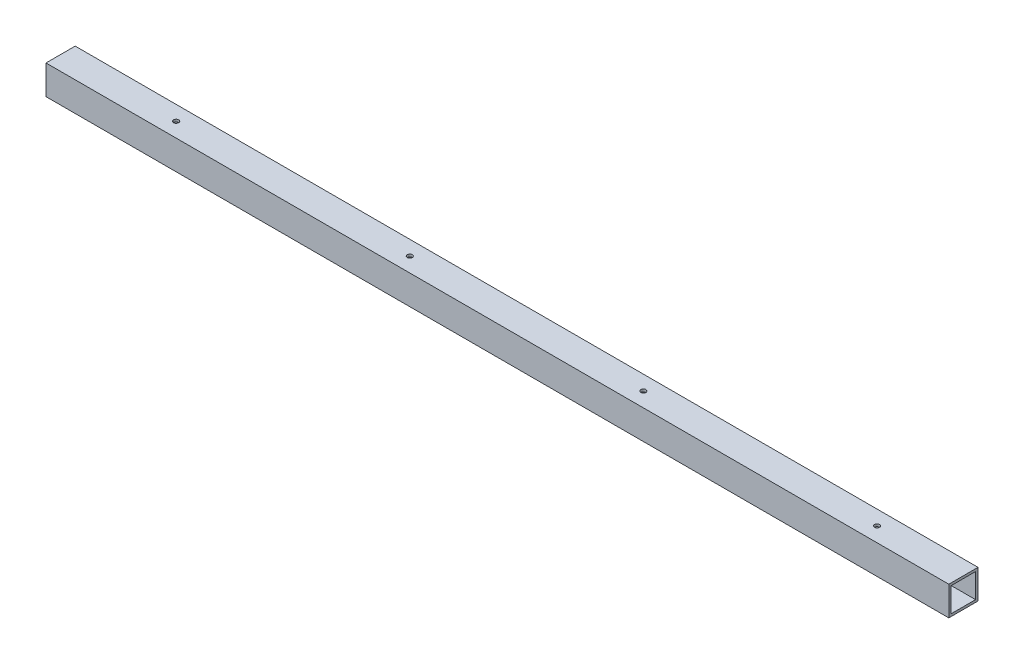
ISO-10303-21;
HEADER;
FILE_DESCRIPTION(('STEP AP214'),'2;1');
FILE_NAME('part.step','',(''),(''),'','','');
FILE_SCHEMA(('AUTOMOTIVE_DESIGN { 1 0 10303 214 1 1 1 1 }'));
ENDSEC;
DATA;
#1=APPLICATION_CONTEXT('core data for automotive mechanical design processes');
#2=APPLICATION_PROTOCOL_DEFINITION('international standard','automotive_design',2000,#1);
#3=PRODUCT_CONTEXT('',#1,'mechanical');
#4=PRODUCT('Part','Part','',(#3));
#5=PRODUCT_RELATED_PRODUCT_CATEGORY('part','',(#4));
#6=PRODUCT_DEFINITION_FORMATION('','',#4);
#7=PRODUCT_DEFINITION_CONTEXT('part definition',#1,'design');
#8=PRODUCT_DEFINITION('design','',#6,#7);
#9=PRODUCT_DEFINITION_SHAPE('','',#8);
#10=(LENGTH_UNIT() NAMED_UNIT(*) SI_UNIT(.MILLI.,.METRE.));
#11=(NAMED_UNIT(*) PLANE_ANGLE_UNIT() SI_UNIT($,.RADIAN.));
#12=(NAMED_UNIT(*) SI_UNIT($,.STERADIAN.) SOLID_ANGLE_UNIT());
#13=UNCERTAINTY_MEASURE_WITH_UNIT(LENGTH_MEASURE(1.E-05),#10,'distance_accuracy_value','');
#14=(GEOMETRIC_REPRESENTATION_CONTEXT(3) GLOBAL_UNCERTAINTY_ASSIGNED_CONTEXT((#13)) GLOBAL_UNIT_ASSIGNED_CONTEXT((#10,
#11,#12)) REPRESENTATION_CONTEXT('',''));
#15=CARTESIAN_POINT('',(0.,0.,0.));
#16=DIRECTION('',(0.,0.,1.));
#17=DIRECTION('',(1.,0.,0.));
#18=AXIS2_PLACEMENT_3D('',#15,#16,#17);
#19=CARTESIAN_POINT('',(476.25,-19.05,0.));
#20=DIRECTION('',(0.,1.,0.));
#21=DIRECTION('',(0.,0.,1.));
#22=AXIS2_PLACEMENT_3D('',#19,#20,#21);
#23=CYLINDRICAL_SURFACE('',#22,3.302);
#24=CARTESIAN_POINT('',(476.25,15.875,0.));
#25=DIRECTION('',(0.,1.,0.));
#26=DIRECTION('',(0.,0.,1.));
#27=AXIS2_PLACEMENT_3D('',#24,#25,#26);
#28=CIRCLE('',#27,3.302);
#29=CARTESIAN_POINT('',(476.25,15.875,3.302));
#30=VERTEX_POINT('',#29);
#31=EDGE_CURVE('E123',#30,#30,#28,.T.);
#32=ORIENTED_EDGE('',*,*,#31,.F.);
#33=EDGE_LOOP('',(#32));
#34=FACE_BOUND('',#33,.T.);
#35=CARTESIAN_POINT('',(476.25,19.05,0.));
#36=DIRECTION('',(0.,1.,0.));
#37=DIRECTION('',(0.,0.,1.));
#38=AXIS2_PLACEMENT_3D('',#35,#36,#37);
#39=CIRCLE('',#38,3.302);
#40=CARTESIAN_POINT('',(476.25,19.05,3.302));
#41=VERTEX_POINT('',#40);
#42=EDGE_CURVE('E120',#41,#41,#39,.F.);
#43=ORIENTED_EDGE('',*,*,#42,.F.);
#44=EDGE_LOOP('',(#43));
#45=FACE_BOUND('',#44,.T.);
#46=ADVANCED_FACE('F17',(#34,#45),#23,.F.);
#47=CARTESIAN_POINT('',(171.45,-19.05,0.));
#48=DIRECTION('',(0.,1.,0.));
#49=DIRECTION('',(0.,0.,1.));
#50=AXIS2_PLACEMENT_3D('',#47,#48,#49);
#51=CYLINDRICAL_SURFACE('',#50,3.302);
#52=CARTESIAN_POINT('',(171.45,15.875,0.));
#53=DIRECTION('',(0.,1.,0.));
#54=DIRECTION('',(0.,0.,1.));
#55=AXIS2_PLACEMENT_3D('',#52,#53,#54);
#56=CIRCLE('',#55,3.302);
#57=CARTESIAN_POINT('',(171.45,15.875,3.302));
#58=VERTEX_POINT('',#57);
#59=EDGE_CURVE('E156',#58,#58,#56,.T.);
#60=ORIENTED_EDGE('',*,*,#59,.F.);
#61=EDGE_LOOP('',(#60));
#62=FACE_BOUND('',#61,.T.);
#63=CARTESIAN_POINT('',(171.45,19.05,0.));
#64=DIRECTION('',(0.,1.,0.));
#65=DIRECTION('',(0.,0.,1.));
#66=AXIS2_PLACEMENT_3D('',#63,#64,#65);
#67=CIRCLE('',#66,3.302);
#68=CARTESIAN_POINT('',(171.45,19.05,3.302));
#69=VERTEX_POINT('',#68);
#70=EDGE_CURVE('E146',#69,#69,#67,.F.);
#71=ORIENTED_EDGE('',*,*,#70,.F.);
#72=EDGE_LOOP('',(#71));
#73=FACE_BOUND('',#72,.T.);
#74=ADVANCED_FACE('F361',(#62,#73),#51,.F.);
#75=CARTESIAN_POINT('',(-133.35,-19.05,0.));
#76=DIRECTION('',(0.,1.,0.));
#77=DIRECTION('',(0.,0.,1.));
#78=AXIS2_PLACEMENT_3D('',#75,#76,#77);
#79=CYLINDRICAL_SURFACE('',#78,3.302);
#80=CARTESIAN_POINT('',(-133.35,15.875,0.));
#81=DIRECTION('',(0.,1.,0.));
#82=DIRECTION('',(0.,0.,1.));
#83=AXIS2_PLACEMENT_3D('',#80,#81,#82);
#84=CIRCLE('',#83,3.302);
#85=CARTESIAN_POINT('',(-133.35,15.875,3.302));
#86=VERTEX_POINT('',#85);
#87=EDGE_CURVE('E153',#86,#86,#84,.T.);
#88=ORIENTED_EDGE('',*,*,#87,.F.);
#89=EDGE_LOOP('',(#88));
#90=FACE_BOUND('',#89,.T.);
#91=CARTESIAN_POINT('',(-133.35,19.05,0.));
#92=DIRECTION('',(0.,1.,0.));
#93=DIRECTION('',(0.,0.,1.));
#94=AXIS2_PLACEMENT_3D('',#91,#92,#93);
#95=CIRCLE('',#94,3.302);
#96=CARTESIAN_POINT('',(-133.35,19.05,3.302));
#97=VERTEX_POINT('',#96);
#98=EDGE_CURVE('E143',#97,#97,#95,.F.);
#99=ORIENTED_EDGE('',*,*,#98,.F.);
#100=EDGE_LOOP('',(#99));
#101=FACE_BOUND('',#100,.T.);
#102=ADVANCED_FACE('F351',(#90,#101),#79,.F.);
#103=CARTESIAN_POINT('',(-438.15,-19.05,0.));
#104=DIRECTION('',(0.,1.,0.));
#105=DIRECTION('',(0.,0.,1.));
#106=AXIS2_PLACEMENT_3D('',#103,#104,#105);
#107=CYLINDRICAL_SURFACE('',#106,3.302);
#108=CARTESIAN_POINT('',(-438.15,15.875,0.));
#109=DIRECTION('',(0.,1.,0.));
#110=DIRECTION('',(0.,0.,1.));
#111=AXIS2_PLACEMENT_3D('',#108,#109,#110);
#112=CIRCLE('',#111,3.302);
#113=CARTESIAN_POINT('',(-438.15,15.875,3.302));
#114=VERTEX_POINT('',#113);
#115=EDGE_CURVE('E121',#114,#114,#112,.T.);
#116=ORIENTED_EDGE('',*,*,#115,.F.);
#117=EDGE_LOOP('',(#116));
#118=FACE_BOUND('',#117,.T.);
#119=CARTESIAN_POINT('',(-438.15,19.05,0.));
#120=DIRECTION('',(0.,1.,0.));
#121=DIRECTION('',(0.,0.,1.));
#122=AXIS2_PLACEMENT_3D('',#119,#120,#121);
#123=CIRCLE('',#122,3.302);
#124=CARTESIAN_POINT('',(-438.15,19.05,3.302));
#125=VERTEX_POINT('',#124);
#126=EDGE_CURVE('E116',#125,#125,#123,.F.);
#127=ORIENTED_EDGE('',*,*,#126,.F.);
#128=EDGE_LOOP('',(#127));
#129=FACE_BOUND('',#128,.T.);
#130=ADVANCED_FACE('F177',(#118,#129),#107,.F.);
#131=CARTESIAN_POINT('',(476.25,-19.05,0.));
#132=DIRECTION('',(0.,1.,0.));
#133=DIRECTION('',(0.,0.,1.));
#134=AXIS2_PLACEMENT_3D('',#131,#132,#133);
#135=CYLINDRICAL_SURFACE('',#134,3.302);
#136=CARTESIAN_POINT('',(476.25,-15.875,0.));
#137=DIRECTION('',(0.,1.,0.));
#138=DIRECTION('',(0.,0.,1.));
#139=AXIS2_PLACEMENT_3D('',#136,#137,#138);
#140=CIRCLE('',#139,3.302);
#141=CARTESIAN_POINT('',(476.25,-15.875,3.302));
#142=VERTEX_POINT('',#141);
#143=EDGE_CURVE('E20',#142,#142,#140,.F.);
#144=ORIENTED_EDGE('',*,*,#143,.F.);
#145=EDGE_LOOP('',(#144));
#146=FACE_BOUND('',#145,.T.);
#147=CARTESIAN_POINT('',(476.25,-19.05,0.));
#148=DIRECTION('',(0.,1.,0.));
#149=DIRECTION('',(0.,0.,1.));
#150=AXIS2_PLACEMENT_3D('',#147,#148,#149);
#151=CIRCLE('',#150,3.302);
#152=CARTESIAN_POINT('',(476.25,-19.05,3.302));
#153=VERTEX_POINT('',#152);
#154=EDGE_CURVE('E137',#153,#153,#151,.T.);
#155=ORIENTED_EDGE('',*,*,#154,.F.);
#156=EDGE_LOOP('',(#155));
#157=FACE_BOUND('',#156,.T.);
#158=ADVANCED_FACE('F173',(#146,#157),#135,.F.);
#159=CARTESIAN_POINT('',(171.45,-19.05,0.));
#160=DIRECTION('',(0.,1.,0.));
#161=DIRECTION('',(0.,0.,1.));
#162=AXIS2_PLACEMENT_3D('',#159,#160,#161);
#163=CYLINDRICAL_SURFACE('',#162,3.302);
#164=CARTESIAN_POINT('',(171.45,-15.875,0.));
#165=DIRECTION('',(0.,1.,0.));
#166=DIRECTION('',(0.,0.,1.));
#167=AXIS2_PLACEMENT_3D('',#164,#165,#166);
#168=CIRCLE('',#167,3.302);
#169=CARTESIAN_POINT('',(171.45,-15.875,3.302));
#170=VERTEX_POINT('',#169);
#171=EDGE_CURVE('E165',#170,#170,#168,.F.);
#172=ORIENTED_EDGE('',*,*,#171,.F.);
#173=EDGE_LOOP('',(#172));
#174=FACE_BOUND('',#173,.T.);
#175=CARTESIAN_POINT('',(171.45,-19.05,0.));
#176=DIRECTION('',(0.,1.,0.));
#177=DIRECTION('',(0.,0.,1.));
#178=AXIS2_PLACEMENT_3D('',#175,#176,#177);
#179=CIRCLE('',#178,3.302);
#180=CARTESIAN_POINT('',(171.45,-19.05,3.302));
#181=VERTEX_POINT('',#180);
#182=EDGE_CURVE('E134',#181,#181,#179,.T.);
#183=ORIENTED_EDGE('',*,*,#182,.F.);
#184=EDGE_LOOP('',(#183));
#185=FACE_BOUND('',#184,.T.);
#186=ADVANCED_FACE('F176',(#174,#185),#163,.F.);
#187=CARTESIAN_POINT('',(-133.35,-19.05,0.));
#188=DIRECTION('',(0.,1.,0.));
#189=DIRECTION('',(0.,0.,1.));
#190=AXIS2_PLACEMENT_3D('',#187,#188,#189);
#191=CYLINDRICAL_SURFACE('',#190,3.302);
#192=CARTESIAN_POINT('',(-133.35,-15.875,0.));
#193=DIRECTION('',(0.,1.,0.));
#194=DIRECTION('',(0.,0.,1.));
#195=AXIS2_PLACEMENT_3D('',#192,#193,#194);
#196=CIRCLE('',#195,3.302);
#197=CARTESIAN_POINT('',(-133.35,-15.875,3.302));
#198=VERTEX_POINT('',#197);
#199=EDGE_CURVE('E163',#198,#198,#196,.F.);
#200=ORIENTED_EDGE('',*,*,#199,.F.);
#201=EDGE_LOOP('',(#200));
#202=FACE_BOUND('',#201,.T.);
#203=CARTESIAN_POINT('',(-133.35,-19.05,0.));
#204=DIRECTION('',(0.,1.,0.));
#205=DIRECTION('',(0.,0.,1.));
#206=AXIS2_PLACEMENT_3D('',#203,#204,#205);
#207=CIRCLE('',#206,3.302);
#208=CARTESIAN_POINT('',(-133.35,-19.05,3.302));
#209=VERTEX_POINT('',#208);
#210=EDGE_CURVE('E131',#209,#209,#207,.T.);
#211=ORIENTED_EDGE('',*,*,#210,.F.);
#212=EDGE_LOOP('',(#211));
#213=FACE_BOUND('',#212,.T.);
#214=ADVANCED_FACE('F317',(#202,#213),#191,.F.);
#215=CARTESIAN_POINT('',(-438.15,-19.05,0.));
#216=DIRECTION('',(0.,1.,0.));
#217=DIRECTION('',(0.,0.,1.));
#218=AXIS2_PLACEMENT_3D('',#215,#216,#217);
#219=CYLINDRICAL_SURFACE('',#218,3.302);
#220=CARTESIAN_POINT('',(-438.15,-15.875,0.));
#221=DIRECTION('',(0.,1.,0.));
#222=DIRECTION('',(0.,0.,1.));
#223=AXIS2_PLACEMENT_3D('',#220,#221,#222);
#224=CIRCLE('',#223,3.302);
#225=CARTESIAN_POINT('',(-438.15,-15.875,3.302));
#226=VERTEX_POINT('',#225);
#227=EDGE_CURVE('E92',#226,#226,#224,.F.);
#228=ORIENTED_EDGE('',*,*,#227,.F.);
#229=EDGE_LOOP('',(#228));
#230=FACE_BOUND('',#229,.T.);
#231=CARTESIAN_POINT('',(-438.15,-19.05,0.));
#232=DIRECTION('',(0.,1.,0.));
#233=DIRECTION('',(0.,0.,1.));
#234=AXIS2_PLACEMENT_3D('',#231,#232,#233);
#235=CIRCLE('',#234,3.302);
#236=CARTESIAN_POINT('',(-438.15,-19.05,3.302));
#237=VERTEX_POINT('',#236);
#238=EDGE_CURVE('E127',#237,#237,#235,.T.);
#239=ORIENTED_EDGE('',*,*,#238,.F.);
#240=EDGE_LOOP('',(#239));
#241=FACE_BOUND('',#240,.T.);
#242=ADVANCED_FACE('F308',(#230,#241),#219,.F.);
#243=CARTESIAN_POINT('',(-588.9625,19.05,19.05));
#244=DIRECTION('',(0.,0.,1.));
#245=DIRECTION('',(1.,0.,0.));
#246=AXIS2_PLACEMENT_3D('',#243,#244,#245);
#247=PLANE('',#246);
#248=DIRECTION('',(1.,0.,0.));
#249=VECTOR('',#248,1.);
#250=CARTESIAN_POINT('',(-588.9625,19.05,19.05));
#251=LINE('',#250,#249);
#252=CARTESIAN_POINT('',(-588.9625,19.05,19.05));
#253=VERTEX_POINT('',#252);
#254=CARTESIAN_POINT('',(588.9625,19.05,19.05));
#255=VERTEX_POINT('',#254);
#256=EDGE_CURVE('E117',#253,#255,#251,.T.);
#257=ORIENTED_EDGE('',*,*,#256,.F.);
#258=DIRECTION('',(0.,1.,0.));
#259=VECTOR('',#258,1.);
#260=CARTESIAN_POINT('',(-588.9625,0.,19.05));
#261=LINE('',#260,#259);
#262=CARTESIAN_POINT('',(-588.9625,-19.05,19.05));
#263=VERTEX_POINT('',#262);
#264=EDGE_CURVE('E195',#253,#263,#261,.F.);
#265=ORIENTED_EDGE('',*,*,#264,.T.);
#266=DIRECTION('',(1.,0.,0.));
#267=VECTOR('',#266,1.);
#268=CARTESIAN_POINT('',(-588.9625,-19.05,19.05));
#269=LINE('',#268,#267);
#270=CARTESIAN_POINT('',(588.9625,-19.05,19.05));
#271=VERTEX_POINT('',#270);
#272=EDGE_CURVE('E140',#271,#263,#269,.F.);
#273=ORIENTED_EDGE('',*,*,#272,.F.);
#274=DIRECTION('',(0.,1.,0.));
#275=VECTOR('',#274,1.);
#276=CARTESIAN_POINT('',(588.9625,0.,19.05));
#277=LINE('',#276,#275);
#278=EDGE_CURVE('E111',#255,#271,#277,.F.);
#279=ORIENTED_EDGE('',*,*,#278,.F.);
#280=EDGE_LOOP('',(#257,#265,#273,#279));
#281=FACE_BOUND('',#280,.T.);
#282=ADVANCED_FACE('F228',(#281),#247,.T.);
#283=CARTESIAN_POINT('',(-588.9625,15.875,-15.875));
#284=DIRECTION('',(0.,0.,1.));
#285=DIRECTION('',(1.,0.,0.));
#286=AXIS2_PLACEMENT_3D('',#283,#284,#285);
#287=PLANE('',#286);
#288=DIRECTION('',(1.,0.,0.));
#289=VECTOR('',#288,1.);
#290=CARTESIAN_POINT('',(-588.9625,15.875,-15.875));
#291=LINE('',#290,#289);
#292=CARTESIAN_POINT('',(-588.9625,15.875,-15.875));
#293=VERTEX_POINT('',#292);
#294=CARTESIAN_POINT('',(588.9625,15.875,-15.875));
#295=VERTEX_POINT('',#294);
#296=EDGE_CURVE('E91',#293,#295,#291,.T.);
#297=ORIENTED_EDGE('',*,*,#296,.F.);
#298=DIRECTION('',(0.,1.,0.));
#299=VECTOR('',#298,1.);
#300=CARTESIAN_POINT('',(-588.9625,0.,-15.875));
#301=LINE('',#300,#299);
#302=CARTESIAN_POINT('',(-588.9625,-15.875,-15.875));
#303=VERTEX_POINT('',#302);
#304=EDGE_CURVE('E197',#293,#303,#301,.F.);
#305=ORIENTED_EDGE('',*,*,#304,.T.);
#306=DIRECTION('',(1.,0.,0.));
#307=VECTOR('',#306,1.);
#308=CARTESIAN_POINT('',(-588.9625,-15.875,-15.875));
#309=LINE('',#308,#307);
#310=CARTESIAN_POINT('',(588.9625,-15.875,-15.875));
#311=VERTEX_POINT('',#310);
#312=EDGE_CURVE('E125',#311,#303,#309,.F.);
#313=ORIENTED_EDGE('',*,*,#312,.F.);
#314=DIRECTION('',(0.,1.,0.));
#315=VECTOR('',#314,1.);
#316=CARTESIAN_POINT('',(588.9625,0.,-15.875));
#317=LINE('',#316,#315);
#318=EDGE_CURVE('E107',#295,#311,#317,.F.);
#319=ORIENTED_EDGE('',*,*,#318,.F.);
#320=EDGE_LOOP('',(#297,#305,#313,#319));
#321=FACE_BOUND('',#320,.T.);
#322=ADVANCED_FACE('F213',(#321),#287,.T.);
#323=CARTESIAN_POINT('',(-588.9625,-15.875,-15.875));
#324=DIRECTION('',(0.,1.,0.));
#325=DIRECTION('',(0.,0.,1.));
#326=AXIS2_PLACEMENT_3D('',#323,#324,#325);
#327=PLANE('',#326);
#328=ORIENTED_EDGE('',*,*,#227,.T.);
#329=EDGE_LOOP('',(#328));
#330=FACE_BOUND('',#329,.T.);
#331=ORIENTED_EDGE('',*,*,#199,.T.);
#332=EDGE_LOOP('',(#331));
#333=FACE_BOUND('',#332,.T.);
#334=ORIENTED_EDGE('',*,*,#171,.T.);
#335=EDGE_LOOP('',(#334));
#336=FACE_BOUND('',#335,.T.);
#337=ORIENTED_EDGE('',*,*,#143,.T.);
#338=EDGE_LOOP('',(#337));
#339=FACE_BOUND('',#338,.T.);
#340=ORIENTED_EDGE('',*,*,#312,.T.);
#341=DIRECTION('',(0.,0.,-1.));
#342=VECTOR('',#341,1.);
#343=CARTESIAN_POINT('',(-588.9625,-15.875,0.));
#344=LINE('',#343,#342);
#345=CARTESIAN_POINT('',(-588.9625,-15.875,15.875));
#346=VERTEX_POINT('',#345);
#347=EDGE_CURVE('E88',#303,#346,#344,.F.);
#348=ORIENTED_EDGE('',*,*,#347,.T.);
#349=DIRECTION('',(-1.,0.,0.));
#350=VECTOR('',#349,1.);
#351=CARTESIAN_POINT('',(-588.9625,-15.875,15.875));
#352=LINE('',#351,#350);
#353=CARTESIAN_POINT('',(588.9625,-15.875,15.875));
#354=VERTEX_POINT('',#353);
#355=EDGE_CURVE('E80',#354,#346,#352,.T.);
#356=ORIENTED_EDGE('',*,*,#355,.F.);
#357=DIRECTION('',(0.,0.,-1.));
#358=VECTOR('',#357,1.);
#359=CARTESIAN_POINT('',(588.9625,-15.875,0.));
#360=LINE('',#359,#358);
#361=EDGE_CURVE('E85',#311,#354,#360,.F.);
#362=ORIENTED_EDGE('',*,*,#361,.F.);
#363=EDGE_LOOP('',(#340,#348,#356,#362));
#364=FACE_BOUND('',#363,.T.);
#365=ADVANCED_FACE('F83',(#330,#333,#336,#339,#364),#327,.T.);
#366=CARTESIAN_POINT('',(-588.9625,-15.875,15.875));
#367=DIRECTION('',(0.,0.,-1.));
#368=DIRECTION('',(-1.,0.,0.));
#369=AXIS2_PLACEMENT_3D('',#366,#367,#368);
#370=PLANE('',#369);
#371=ORIENTED_EDGE('',*,*,#355,.T.);
#372=DIRECTION('',(0.,1.,0.));
#373=VECTOR('',#372,1.);
#374=CARTESIAN_POINT('',(-588.9625,0.,15.875));
#375=LINE('',#374,#373);
#376=CARTESIAN_POINT('',(-588.9625,15.875,15.875));
#377=VERTEX_POINT('',#376);
#378=EDGE_CURVE('E215',#346,#377,#375,.T.);
#379=ORIENTED_EDGE('',*,*,#378,.T.);
#380=DIRECTION('',(1.,0.,0.));
#381=VECTOR('',#380,1.);
#382=CARTESIAN_POINT('',(-588.9625,15.875,15.875));
#383=LINE('',#382,#381);
#384=CARTESIAN_POINT('',(588.9625,15.875,15.875));
#385=VERTEX_POINT('',#384);
#386=EDGE_CURVE('E98',#385,#377,#383,.F.);
#387=ORIENTED_EDGE('',*,*,#386,.F.);
#388=DIRECTION('',(0.,1.,0.));
#389=VECTOR('',#388,1.);
#390=CARTESIAN_POINT('',(588.9625,0.,15.875));
#391=LINE('',#390,#389);
#392=EDGE_CURVE('E95',#354,#385,#391,.T.);
#393=ORIENTED_EDGE('',*,*,#392,.F.);
#394=EDGE_LOOP('',(#371,#379,#387,#393));
#395=FACE_BOUND('',#394,.T.);
#396=ADVANCED_FACE('F96',(#395),#370,.T.);
#397=CARTESIAN_POINT('',(-588.9625,15.875,15.875));
#398=DIRECTION('',(0.,-1.,0.));
#399=DIRECTION('',(0.,0.,-1.));
#400=AXIS2_PLACEMENT_3D('',#397,#398,#399);
#401=PLANE('',#400);
#402=ORIENTED_EDGE('',*,*,#115,.T.);
#403=EDGE_LOOP('',(#402));
#404=FACE_BOUND('',#403,.T.);
#405=ORIENTED_EDGE('',*,*,#87,.T.);
#406=EDGE_LOOP('',(#405));
#407=FACE_BOUND('',#406,.T.);
#408=ORIENTED_EDGE('',*,*,#59,.T.);
#409=EDGE_LOOP('',(#408));
#410=FACE_BOUND('',#409,.T.);
#411=ORIENTED_EDGE('',*,*,#31,.T.);
#412=EDGE_LOOP('',(#411));
#413=FACE_BOUND('',#412,.T.);
#414=ORIENTED_EDGE('',*,*,#386,.T.);
#415=DIRECTION('',(0.,0.,-1.));
#416=VECTOR('',#415,1.);
#417=CARTESIAN_POINT('',(-588.9625,15.875,0.));
#418=LINE('',#417,#416);
#419=EDGE_CURVE('E210',#377,#293,#418,.T.);
#420=ORIENTED_EDGE('',*,*,#419,.T.);
#421=ORIENTED_EDGE('',*,*,#296,.T.);
#422=DIRECTION('',(0.,0.,-1.));
#423=VECTOR('',#422,1.);
#424=CARTESIAN_POINT('',(588.9625,15.875,0.));
#425=LINE('',#424,#423);
#426=EDGE_CURVE('E102',#385,#295,#425,.T.);
#427=ORIENTED_EDGE('',*,*,#426,.F.);
#428=EDGE_LOOP('',(#414,#420,#421,#427));
#429=FACE_BOUND('',#428,.T.);
#430=ADVANCED_FACE('F207',(#404,#407,#410,#413,#429),#401,.T.);
#431=CARTESIAN_POINT('',(-588.9625,19.05,-19.05));
#432=DIRECTION('',(0.,1.,0.));
#433=DIRECTION('',(0.,0.,1.));
#434=AXIS2_PLACEMENT_3D('',#431,#432,#433);
#435=PLANE('',#434);
#436=ORIENTED_EDGE('',*,*,#126,.T.);
#437=EDGE_LOOP('',(#436));
#438=FACE_BOUND('',#437,.T.);
#439=ORIENTED_EDGE('',*,*,#98,.T.);
#440=EDGE_LOOP('',(#439));
#441=FACE_BOUND('',#440,.T.);
#442=ORIENTED_EDGE('',*,*,#70,.T.);
#443=EDGE_LOOP('',(#442));
#444=FACE_BOUND('',#443,.T.);
#445=ORIENTED_EDGE('',*,*,#42,.T.);
#446=EDGE_LOOP('',(#445));
#447=FACE_BOUND('',#446,.T.);
#448=DIRECTION('',(-1.,0.,0.));
#449=VECTOR('',#448,1.);
#450=CARTESIAN_POINT('',(-588.9625,19.05,-19.05));
#451=LINE('',#450,#449);
#452=CARTESIAN_POINT('',(-588.9625,19.05,-19.05));
#453=VERTEX_POINT('',#452);
#454=CARTESIAN_POINT('',(588.9625,19.05,-19.05));
#455=VERTEX_POINT('',#454);
#456=EDGE_CURVE('E219',#453,#455,#451,.F.);
#457=ORIENTED_EDGE('',*,*,#456,.F.);
#458=DIRECTION('',(0.,0.,-1.));
#459=VECTOR('',#458,1.);
#460=CARTESIAN_POINT('',(-588.9625,19.05,0.));
#461=LINE('',#460,#459);
#462=EDGE_CURVE('E130',#453,#253,#461,.F.);
#463=ORIENTED_EDGE('',*,*,#462,.T.);
#464=ORIENTED_EDGE('',*,*,#256,.T.);
#465=DIRECTION('',(0.,0.,-1.));
#466=VECTOR('',#465,1.);
#467=CARTESIAN_POINT('',(588.9625,19.05,0.));
#468=LINE('',#467,#466);
#469=EDGE_CURVE('E108',#455,#255,#468,.F.);
#470=ORIENTED_EDGE('',*,*,#469,.F.);
#471=EDGE_LOOP('',(#457,#463,#464,#470));
#472=FACE_BOUND('',#471,.T.);
#473=ADVANCED_FACE('F230',(#438,#441,#444,#447,#472),#435,.T.);
#474=CARTESIAN_POINT('',(588.9625,0.,0.));
#475=DIRECTION('',(1.,0.,0.));
#476=DIRECTION('',(0.,0.,-1.));
#477=AXIS2_PLACEMENT_3D('',#474,#475,#476);
#478=PLANE('',#477);
#479=ORIENTED_EDGE('',*,*,#426,.T.);
#480=ORIENTED_EDGE('',*,*,#318,.T.);
#481=ORIENTED_EDGE('',*,*,#361,.T.);
#482=ORIENTED_EDGE('',*,*,#392,.T.);
#483=EDGE_LOOP('',(#479,#480,#481,#482));
#484=FACE_BOUND('',#483,.T.);
#485=DIRECTION('',(0.,1.,0.));
#486=VECTOR('',#485,1.);
#487=CARTESIAN_POINT('',(588.9625,-19.05,-19.05));
#488=LINE('',#487,#486);
#489=CARTESIAN_POINT('',(588.9625,-19.05,-19.05));
#490=VERTEX_POINT('',#489);
#491=EDGE_CURVE('E222',#455,#490,#488,.F.);
#492=ORIENTED_EDGE('',*,*,#491,.F.);
#493=ORIENTED_EDGE('',*,*,#469,.T.);
#494=ORIENTED_EDGE('',*,*,#278,.T.);
#495=DIRECTION('',(0.,0.,-1.));
#496=VECTOR('',#495,1.);
#497=CARTESIAN_POINT('',(588.9625,-19.05,19.05));
#498=LINE('',#497,#496);
#499=EDGE_CURVE('E188',#490,#271,#498,.F.);
#500=ORIENTED_EDGE('',*,*,#499,.F.);
#501=EDGE_LOOP('',(#492,#493,#494,#500));
#502=FACE_BOUND('',#501,.T.);
#503=ADVANCED_FACE('F104',(#484,#502),#478,.T.);
#504=CARTESIAN_POINT('',(-588.9625,-19.05,19.05));
#505=DIRECTION('',(0.,-1.,0.));
#506=DIRECTION('',(0.,0.,-1.));
#507=AXIS2_PLACEMENT_3D('',#504,#505,#506);
#508=PLANE('',#507);
#509=ORIENTED_EDGE('',*,*,#238,.T.);
#510=EDGE_LOOP('',(#509));
#511=FACE_BOUND('',#510,.T.);
#512=ORIENTED_EDGE('',*,*,#210,.T.);
#513=EDGE_LOOP('',(#512));
#514=FACE_BOUND('',#513,.T.);
#515=ORIENTED_EDGE('',*,*,#182,.T.);
#516=EDGE_LOOP('',(#515));
#517=FACE_BOUND('',#516,.T.);
#518=ORIENTED_EDGE('',*,*,#154,.T.);
#519=EDGE_LOOP('',(#518));
#520=FACE_BOUND('',#519,.T.);
#521=ORIENTED_EDGE('',*,*,#272,.T.);
#522=DIRECTION('',(0.,0.,-1.));
#523=VECTOR('',#522,1.);
#524=CARTESIAN_POINT('',(-588.9625,-19.05,0.));
#525=LINE('',#524,#523);
#526=CARTESIAN_POINT('',(-588.9625,-19.05,-19.05));
#527=VERTEX_POINT('',#526);
#528=EDGE_CURVE('E35',#263,#527,#525,.T.);
#529=ORIENTED_EDGE('',*,*,#528,.T.);
#530=DIRECTION('',(-1.,0.,0.));
#531=VECTOR('',#530,1.);
#532=CARTESIAN_POINT('',(-588.9625,-19.05,-19.05));
#533=LINE('',#532,#531);
#534=EDGE_CURVE('E26',#490,#527,#533,.T.);
#535=ORIENTED_EDGE('',*,*,#534,.F.);
#536=ORIENTED_EDGE('',*,*,#499,.T.);
#537=EDGE_LOOP('',(#521,#529,#535,#536));
#538=FACE_BOUND('',#537,.T.);
#539=ADVANCED_FACE('F181',(#511,#514,#517,#520,#538),#508,.T.);
#540=CARTESIAN_POINT('',(-588.9625,0.,0.));
#541=DIRECTION('',(1.,0.,0.));
#542=DIRECTION('',(0.,0.,-1.));
#543=AXIS2_PLACEMENT_3D('',#540,#541,#542);
#544=PLANE('',#543);
#545=ORIENTED_EDGE('',*,*,#378,.F.);
#546=ORIENTED_EDGE('',*,*,#347,.F.);
#547=ORIENTED_EDGE('',*,*,#304,.F.);
#548=ORIENTED_EDGE('',*,*,#419,.F.);
#549=EDGE_LOOP('',(#545,#546,#547,#548));
#550=FACE_BOUND('',#549,.T.);
#551=ORIENTED_EDGE('',*,*,#528,.F.);
#552=ORIENTED_EDGE('',*,*,#264,.F.);
#553=ORIENTED_EDGE('',*,*,#462,.F.);
#554=DIRECTION('',(0.,1.,0.));
#555=VECTOR('',#554,1.);
#556=CARTESIAN_POINT('',(-588.9625,-19.05,-19.05));
#557=LINE('',#556,#555);
#558=EDGE_CURVE('E11',#527,#453,#557,.T.);
#559=ORIENTED_EDGE('',*,*,#558,.F.);
#560=EDGE_LOOP('',(#551,#552,#553,#559));
#561=FACE_BOUND('',#560,.T.);
#562=ADVANCED_FACE('F183',(#550,#561),#544,.F.);
#563=CARTESIAN_POINT('',(-588.9625,-19.05,-19.05));
#564=DIRECTION('',(0.,0.,-1.));
#565=DIRECTION('',(-1.,0.,0.));
#566=AXIS2_PLACEMENT_3D('',#563,#564,#565);
#567=PLANE('',#566);
#568=ORIENTED_EDGE('',*,*,#534,.T.);
#569=ORIENTED_EDGE('',*,*,#558,.T.);
#570=ORIENTED_EDGE('',*,*,#456,.T.);
#571=ORIENTED_EDGE('',*,*,#491,.T.);
#572=EDGE_LOOP('',(#568,#569,#570,#571));
#573=FACE_BOUND('',#572,.T.);
#574=ADVANCED_FACE('F226',(#573),#567,.T.);
#575=CLOSED_SHELL('',(#46,#74,#102,#130,#158,#186,#214,#242,#282,#322,#365,#396,#430,#473,#503,
#539,#562,#574));
#576=MANIFOLD_SOLID_BREP('B1',#575);
#577=ADVANCED_BREP_SHAPE_REPRESENTATION('',(#18,#576),#14);
#578=SHAPE_DEFINITION_REPRESENTATION(#9,#577);
ENDSEC;
END-ISO-10303-21;
